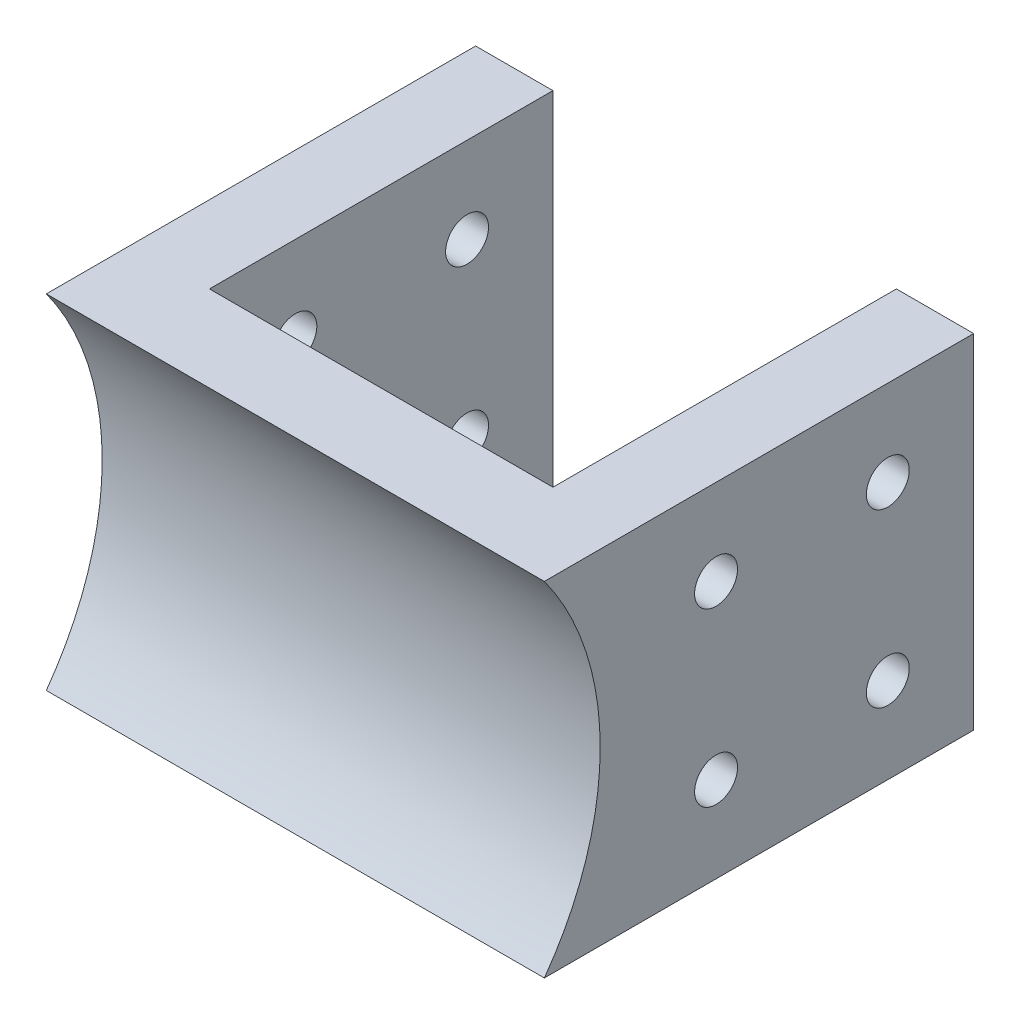
ISO-10303-21;
HEADER;
FILE_DESCRIPTION(('STEP AP214'),'2;1');
FILE_NAME('part.step','',(''),(''),'','','');
FILE_SCHEMA(('AUTOMOTIVE_DESIGN { 1 0 10303 214 1 1 1 1 }'));
ENDSEC;
DATA;
#1=APPLICATION_CONTEXT('core data for automotive mechanical design processes');
#2=APPLICATION_PROTOCOL_DEFINITION('international standard','automotive_design',2000,#1);
#3=PRODUCT_CONTEXT('',#1,'mechanical');
#4=PRODUCT('Part','Part','',(#3));
#5=PRODUCT_RELATED_PRODUCT_CATEGORY('part','',(#4));
#6=PRODUCT_DEFINITION_FORMATION('','',#4);
#7=PRODUCT_DEFINITION_CONTEXT('part definition',#1,'design');
#8=PRODUCT_DEFINITION('design','',#6,#7);
#9=PRODUCT_DEFINITION_SHAPE('','',#8);
#10=(LENGTH_UNIT() NAMED_UNIT(*) SI_UNIT(.MILLI.,.METRE.));
#11=(NAMED_UNIT(*) PLANE_ANGLE_UNIT() SI_UNIT($,.RADIAN.));
#12=(NAMED_UNIT(*) SI_UNIT($,.STERADIAN.) SOLID_ANGLE_UNIT());
#13=UNCERTAINTY_MEASURE_WITH_UNIT(LENGTH_MEASURE(1.E-05),#10,'distance_accuracy_value','');
#14=(GEOMETRIC_REPRESENTATION_CONTEXT(3) GLOBAL_UNCERTAINTY_ASSIGNED_CONTEXT((#13)) GLOBAL_UNIT_ASSIGNED_CONTEXT((#10,
#11,#12)) REPRESENTATION_CONTEXT('',''));
#15=CARTESIAN_POINT('',(0.,0.,0.));
#16=DIRECTION('',(0.,0.,1.));
#17=DIRECTION('',(1.,0.,0.));
#18=AXIS2_PLACEMENT_3D('',#15,#16,#17);
#19=CARTESIAN_POINT('',(0.,40.,-50.));
#20=DIRECTION('',(1.,0.,0.));
#21=DIRECTION('',(0.,0.,-1.));
#22=AXIS2_PLACEMENT_3D('',#19,#20,#21);
#23=PLANE('',#22);
#24=CARTESIAN_POINT('',(0.,30.,-20.));
#25=DIRECTION('',(-1.,0.,0.));
#26=DIRECTION('',(0.,0.,1.));
#27=AXIS2_PLACEMENT_3D('',#24,#25,#26);
#28=CIRCLE('',#27,2.5);
#29=CARTESIAN_POINT('',(0.,30.,-17.5));
#30=VERTEX_POINT('',#29);
#31=EDGE_CURVE('E228',#30,#30,#28,.T.);
#32=ORIENTED_EDGE('',*,*,#31,.F.);
#33=EDGE_LOOP('',(#32));
#34=FACE_BOUND('',#33,.T.);
#35=CARTESIAN_POINT('',(0.,10.,-40.));
#36=DIRECTION('',(-1.,0.,0.));
#37=DIRECTION('',(0.,0.,1.));
#38=AXIS2_PLACEMENT_3D('',#35,#36,#37);
#39=CIRCLE('',#38,2.5);
#40=CARTESIAN_POINT('',(0.,10.,-37.5));
#41=VERTEX_POINT('',#40);
#42=EDGE_CURVE('E176',#41,#41,#39,.T.);
#43=ORIENTED_EDGE('',*,*,#42,.F.);
#44=EDGE_LOOP('',(#43));
#45=FACE_BOUND('',#44,.T.);
#46=DIRECTION('',(0.,0.,1.));
#47=VECTOR('',#46,1.);
#48=CARTESIAN_POINT('',(0.,0.,-50.));
#49=LINE('',#48,#47);
#50=CARTESIAN_POINT('',(0.,0.,-50.));
#51=VERTEX_POINT('',#50);
#52=CARTESIAN_POINT('',(0.,0.,0.));
#53=VERTEX_POINT('',#52);
#54=EDGE_CURVE('E128',#51,#53,#49,.T.);
#55=ORIENTED_EDGE('',*,*,#54,.T.);
#56=CARTESIAN_POINT('',(0.,20.,27.495454169735));
#57=DIRECTION('',(1.,0.,0.));
#58=DIRECTION('',(0.,0.,-1.));
#59=AXIS2_PLACEMENT_3D('',#56,#57,#58);
#60=CIRCLE('',#59,34.);
#61=CARTESIAN_POINT('',(0.,40.,0.));
#62=VERTEX_POINT('',#61);
#63=EDGE_CURVE('E206',#53,#62,#60,.T.);
#64=ORIENTED_EDGE('',*,*,#63,.T.);
#65=DIRECTION('',(0.,0.,1.));
#66=VECTOR('',#65,1.);
#67=CARTESIAN_POINT('',(0.,40.,-50.));
#68=LINE('',#67,#66);
#69=CARTESIAN_POINT('',(0.,40.,-50.));
#70=VERTEX_POINT('',#69);
#71=EDGE_CURVE('E144',#70,#62,#68,.T.);
#72=ORIENTED_EDGE('',*,*,#71,.F.);
#73=DIRECTION('',(0.,-1.,0.));
#74=VECTOR('',#73,1.);
#75=CARTESIAN_POINT('',(0.,40.,-50.));
#76=LINE('',#75,#74);
#77=EDGE_CURVE('E124',#70,#51,#76,.T.);
#78=ORIENTED_EDGE('',*,*,#77,.T.);
#79=EDGE_LOOP('',(#55,#64,#72,#78));
#80=FACE_BOUND('',#79,.T.);
#81=CARTESIAN_POINT('',(0.,30.,-40.));
#82=DIRECTION('',(-1.,0.,0.));
#83=DIRECTION('',(0.,0.,1.));
#84=AXIS2_PLACEMENT_3D('',#81,#82,#83);
#85=CIRCLE('',#84,2.5);
#86=CARTESIAN_POINT('',(0.,30.,-37.5));
#87=VERTEX_POINT('',#86);
#88=EDGE_CURVE('E276',#87,#87,#85,.F.);
#89=ORIENTED_EDGE('',*,*,#88,.T.);
#90=EDGE_LOOP('',(#89));
#91=FACE_BOUND('',#90,.T.);
#92=CARTESIAN_POINT('',(0.,10.,-20.));
#93=DIRECTION('',(-1.,0.,0.));
#94=DIRECTION('',(0.,0.,1.));
#95=AXIS2_PLACEMENT_3D('',#92,#93,#94);
#96=CIRCLE('',#95,2.5);
#97=CARTESIAN_POINT('',(0.,10.,-17.5));
#98=VERTEX_POINT('',#97);
#99=EDGE_CURVE('E284',#98,#98,#96,.F.);
#100=ORIENTED_EDGE('',*,*,#99,.T.);
#101=EDGE_LOOP('',(#100));
#102=FACE_BOUND('',#101,.T.);
#103=ADVANCED_FACE('F33',(#34,#45,#80,#91,#102),#23,.F.);
#104=CARTESIAN_POINT('',(58.,40.,0.));
#105=DIRECTION('',(-1.,0.,0.));
#106=DIRECTION('',(0.,0.,1.));
#107=AXIS2_PLACEMENT_3D('',#104,#105,#106);
#108=PLANE('',#107);
#109=CARTESIAN_POINT('',(58.,30.,-20.));
#110=DIRECTION('',(-1.,0.,0.));
#111=DIRECTION('',(0.,0.,1.));
#112=AXIS2_PLACEMENT_3D('',#109,#110,#111);
#113=CIRCLE('',#112,2.5);
#114=CARTESIAN_POINT('',(58.,30.,-17.5));
#115=VERTEX_POINT('',#114);
#116=EDGE_CURVE('E170',#115,#115,#113,.T.);
#117=ORIENTED_EDGE('',*,*,#116,.T.);
#118=EDGE_LOOP('',(#117));
#119=FACE_BOUND('',#118,.T.);
#120=CARTESIAN_POINT('',(58.,10.,-40.));
#121=DIRECTION('',(-1.,0.,0.));
#122=DIRECTION('',(0.,0.,1.));
#123=AXIS2_PLACEMENT_3D('',#120,#121,#122);
#124=CIRCLE('',#123,2.5);
#125=CARTESIAN_POINT('',(58.,10.,-37.5));
#126=VERTEX_POINT('',#125);
#127=EDGE_CURVE('E153',#126,#126,#124,.T.);
#128=ORIENTED_EDGE('',*,*,#127,.T.);
#129=EDGE_LOOP('',(#128));
#130=FACE_BOUND('',#129,.T.);
#131=DIRECTION('',(0.,0.,-1.));
#132=VECTOR('',#131,1.);
#133=CARTESIAN_POINT('',(58.,40.,0.));
#134=LINE('',#133,#132);
#135=CARTESIAN_POINT('',(58.,40.,0.));
#136=VERTEX_POINT('',#135);
#137=CARTESIAN_POINT('',(58.,40.,-50.));
#138=VERTEX_POINT('',#137);
#139=EDGE_CURVE('E92',#136,#138,#134,.T.);
#140=ORIENTED_EDGE('',*,*,#139,.F.);
#141=CARTESIAN_POINT('',(58.,20.,27.495454169735));
#142=DIRECTION('',(1.,0.,0.));
#143=DIRECTION('',(0.,0.,-1.));
#144=AXIS2_PLACEMENT_3D('',#141,#142,#143);
#145=CIRCLE('',#144,34.);
#146=CARTESIAN_POINT('',(58.,0.,0.));
#147=VERTEX_POINT('',#146);
#148=EDGE_CURVE('E280',#147,#136,#145,.T.);
#149=ORIENTED_EDGE('',*,*,#148,.F.);
#150=DIRECTION('',(0.,0.,-1.));
#151=VECTOR('',#150,1.);
#152=CARTESIAN_POINT('',(58.,0.,0.));
#153=LINE('',#152,#151);
#154=CARTESIAN_POINT('',(58.,0.,-50.));
#155=VERTEX_POINT('',#154);
#156=EDGE_CURVE('E135',#147,#155,#153,.T.);
#157=ORIENTED_EDGE('',*,*,#156,.T.);
#158=DIRECTION('',(0.,-1.,0.));
#159=VECTOR('',#158,1.);
#160=CARTESIAN_POINT('',(58.,40.,-50.));
#161=LINE('',#160,#159);
#162=EDGE_CURVE('E11',#138,#155,#161,.T.);
#163=ORIENTED_EDGE('',*,*,#162,.F.);
#164=EDGE_LOOP('',(#140,#149,#157,#163));
#165=FACE_BOUND('',#164,.T.);
#166=CARTESIAN_POINT('',(58.,30.,-40.));
#167=DIRECTION('',(-1.,0.,0.));
#168=DIRECTION('',(0.,0.,1.));
#169=AXIS2_PLACEMENT_3D('',#166,#167,#168);
#170=CIRCLE('',#169,2.5);
#171=CARTESIAN_POINT('',(58.,30.,-37.5));
#172=VERTEX_POINT('',#171);
#173=EDGE_CURVE('E278',#172,#172,#170,.F.);
#174=ORIENTED_EDGE('',*,*,#173,.F.);
#175=EDGE_LOOP('',(#174));
#176=FACE_BOUND('',#175,.T.);
#177=CARTESIAN_POINT('',(58.,10.,-20.));
#178=DIRECTION('',(-1.,0.,0.));
#179=DIRECTION('',(0.,0.,1.));
#180=AXIS2_PLACEMENT_3D('',#177,#178,#179);
#181=CIRCLE('',#180,2.5);
#182=CARTESIAN_POINT('',(58.,10.,-17.5));
#183=VERTEX_POINT('',#182);
#184=EDGE_CURVE('E157',#183,#183,#181,.F.);
#185=ORIENTED_EDGE('',*,*,#184,.F.);
#186=EDGE_LOOP('',(#185));
#187=FACE_BOUND('',#186,.T.);
#188=ADVANCED_FACE('F219',(#119,#130,#165,#176,#187),#108,.F.);
#189=CARTESIAN_POINT('',(49.,40.,-50.));
#190=DIRECTION('',(1.,0.,0.));
#191=DIRECTION('',(0.,0.,-1.));
#192=AXIS2_PLACEMENT_3D('',#189,#190,#191);
#193=PLANE('',#192);
#194=CARTESIAN_POINT('',(49.,30.,-20.));
#195=DIRECTION('',(1.,0.,0.));
#196=DIRECTION('',(0.,0.,-1.));
#197=AXIS2_PLACEMENT_3D('',#194,#195,#196);
#198=CIRCLE('',#197,2.5);
#199=CARTESIAN_POINT('',(49.,30.,-22.5));
#200=VERTEX_POINT('',#199);
#201=EDGE_CURVE('E156',#200,#200,#198,.T.);
#202=ORIENTED_EDGE('',*,*,#201,.T.);
#203=EDGE_LOOP('',(#202));
#204=FACE_BOUND('',#203,.T.);
#205=CARTESIAN_POINT('',(49.,10.,-40.));
#206=DIRECTION('',(1.,0.,0.));
#207=DIRECTION('',(0.,0.,-1.));
#208=AXIS2_PLACEMENT_3D('',#205,#206,#207);
#209=CIRCLE('',#208,2.5);
#210=CARTESIAN_POINT('',(49.,10.,-42.5));
#211=VERTEX_POINT('',#210);
#212=EDGE_CURVE('E132',#211,#211,#209,.T.);
#213=ORIENTED_EDGE('',*,*,#212,.T.);
#214=EDGE_LOOP('',(#213));
#215=FACE_BOUND('',#214,.T.);
#216=DIRECTION('',(0.,0.,1.));
#217=VECTOR('',#216,1.);
#218=CARTESIAN_POINT('',(49.,0.,-50.));
#219=LINE('',#218,#217);
#220=CARTESIAN_POINT('',(49.,0.,-50.));
#221=VERTEX_POINT('',#220);
#222=CARTESIAN_POINT('',(49.,0.,-10.));
#223=VERTEX_POINT('',#222);
#224=EDGE_CURVE('E139',#221,#223,#219,.T.);
#225=ORIENTED_EDGE('',*,*,#224,.T.);
#226=DIRECTION('',(0.,-1.,0.));
#227=VECTOR('',#226,1.);
#228=CARTESIAN_POINT('',(49.,40.,-10.));
#229=LINE('',#228,#227);
#230=CARTESIAN_POINT('',(49.,40.,-10.));
#231=VERTEX_POINT('',#230);
#232=EDGE_CURVE('E118',#231,#223,#229,.T.);
#233=ORIENTED_EDGE('',*,*,#232,.F.);
#234=DIRECTION('',(0.,0.,1.));
#235=VECTOR('',#234,1.);
#236=CARTESIAN_POINT('',(49.,40.,-50.));
#237=LINE('',#236,#235);
#238=CARTESIAN_POINT('',(49.,40.,-50.));
#239=VERTEX_POINT('',#238);
#240=EDGE_CURVE('E109',#239,#231,#237,.T.);
#241=ORIENTED_EDGE('',*,*,#240,.F.);
#242=DIRECTION('',(0.,-1.,0.));
#243=VECTOR('',#242,1.);
#244=CARTESIAN_POINT('',(49.,40.,-50.));
#245=LINE('',#244,#243);
#246=EDGE_CURVE('E42',#239,#221,#245,.T.);
#247=ORIENTED_EDGE('',*,*,#246,.T.);
#248=EDGE_LOOP('',(#225,#233,#241,#247));
#249=FACE_BOUND('',#248,.T.);
#250=CARTESIAN_POINT('',(49.,30.,-40.));
#251=DIRECTION('',(1.,0.,0.));
#252=DIRECTION('',(0.,0.,-1.));
#253=AXIS2_PLACEMENT_3D('',#250,#251,#252);
#254=CIRCLE('',#253,2.5);
#255=CARTESIAN_POINT('',(49.,30.,-42.5));
#256=VERTEX_POINT('',#255);
#257=EDGE_CURVE('E160',#256,#256,#254,.F.);
#258=ORIENTED_EDGE('',*,*,#257,.F.);
#259=EDGE_LOOP('',(#258));
#260=FACE_BOUND('',#259,.T.);
#261=CARTESIAN_POINT('',(49.,10.,-20.));
#262=DIRECTION('',(1.,0.,0.));
#263=DIRECTION('',(0.,0.,-1.));
#264=AXIS2_PLACEMENT_3D('',#261,#262,#263);
#265=CIRCLE('',#264,2.5);
#266=CARTESIAN_POINT('',(49.,10.,-22.5));
#267=VERTEX_POINT('',#266);
#268=EDGE_CURVE('E173',#267,#267,#265,.F.);
#269=ORIENTED_EDGE('',*,*,#268,.F.);
#270=EDGE_LOOP('',(#269));
#271=FACE_BOUND('',#270,.T.);
#272=ADVANCED_FACE('F195',(#204,#215,#249,#260,#271),#193,.F.);
#273=CARTESIAN_POINT('',(9.,40.,-10.));
#274=DIRECTION('',(-1.,0.,0.));
#275=DIRECTION('',(0.,0.,1.));
#276=AXIS2_PLACEMENT_3D('',#273,#274,#275);
#277=PLANE('',#276);
#278=CARTESIAN_POINT('',(9.,30.,-20.));
#279=DIRECTION('',(-1.,0.,0.));
#280=DIRECTION('',(0.,0.,1.));
#281=AXIS2_PLACEMENT_3D('',#278,#279,#280);
#282=CIRCLE('',#281,2.5);
#283=CARTESIAN_POINT('',(9.,30.,-17.5));
#284=VERTEX_POINT('',#283);
#285=EDGE_CURVE('E154',#284,#284,#282,.T.);
#286=ORIENTED_EDGE('',*,*,#285,.T.);
#287=EDGE_LOOP('',(#286));
#288=FACE_BOUND('',#287,.T.);
#289=CARTESIAN_POINT('',(9.,10.,-40.));
#290=DIRECTION('',(-1.,0.,0.));
#291=DIRECTION('',(0.,0.,1.));
#292=AXIS2_PLACEMENT_3D('',#289,#290,#291);
#293=CIRCLE('',#292,2.5);
#294=CARTESIAN_POINT('',(9.,10.,-37.5));
#295=VERTEX_POINT('',#294);
#296=EDGE_CURVE('E150',#295,#295,#293,.T.);
#297=ORIENTED_EDGE('',*,*,#296,.T.);
#298=EDGE_LOOP('',(#297));
#299=FACE_BOUND('',#298,.T.);
#300=DIRECTION('',(0.,0.,-1.));
#301=VECTOR('',#300,1.);
#302=CARTESIAN_POINT('',(9.,0.,-10.));
#303=LINE('',#302,#301);
#304=CARTESIAN_POINT('',(9.,0.,-10.));
#305=VERTEX_POINT('',#304);
#306=CARTESIAN_POINT('',(9.,0.,-50.));
#307=VERTEX_POINT('',#306);
#308=EDGE_CURVE('E78',#305,#307,#303,.T.);
#309=ORIENTED_EDGE('',*,*,#308,.T.);
#310=DIRECTION('',(0.,-1.,0.));
#311=VECTOR('',#310,1.);
#312=CARTESIAN_POINT('',(9.,40.,-50.));
#313=LINE('',#312,#311);
#314=CARTESIAN_POINT('',(9.,40.,-50.));
#315=VERTEX_POINT('',#314);
#316=EDGE_CURVE('E119',#315,#307,#313,.T.);
#317=ORIENTED_EDGE('',*,*,#316,.F.);
#318=DIRECTION('',(0.,0.,-1.));
#319=VECTOR('',#318,1.);
#320=CARTESIAN_POINT('',(9.,40.,-10.));
#321=LINE('',#320,#319);
#322=CARTESIAN_POINT('',(9.,40.,-10.));
#323=VERTEX_POINT('',#322);
#324=EDGE_CURVE('E107',#323,#315,#321,.T.);
#325=ORIENTED_EDGE('',*,*,#324,.F.);
#326=DIRECTION('',(0.,-1.,0.));
#327=VECTOR('',#326,1.);
#328=CARTESIAN_POINT('',(9.,40.,-10.));
#329=LINE('',#328,#327);
#330=EDGE_CURVE('E114',#323,#305,#329,.T.);
#331=ORIENTED_EDGE('',*,*,#330,.T.);
#332=EDGE_LOOP('',(#309,#317,#325,#331));
#333=FACE_BOUND('',#332,.T.);
#334=CARTESIAN_POINT('',(9.,30.,-40.));
#335=DIRECTION('',(-1.,0.,0.));
#336=DIRECTION('',(0.,0.,1.));
#337=AXIS2_PLACEMENT_3D('',#334,#335,#336);
#338=CIRCLE('',#337,2.5);
#339=CARTESIAN_POINT('',(9.,30.,-37.5));
#340=VERTEX_POINT('',#339);
#341=EDGE_CURVE('E158',#340,#340,#338,.F.);
#342=ORIENTED_EDGE('',*,*,#341,.F.);
#343=EDGE_LOOP('',(#342));
#344=FACE_BOUND('',#343,.T.);
#345=CARTESIAN_POINT('',(9.,10.,-20.));
#346=DIRECTION('',(-1.,0.,0.));
#347=DIRECTION('',(0.,0.,1.));
#348=AXIS2_PLACEMENT_3D('',#345,#346,#347);
#349=CIRCLE('',#348,2.5);
#350=CARTESIAN_POINT('',(9.,10.,-17.5));
#351=VERTEX_POINT('',#350);
#352=EDGE_CURVE('E36',#351,#351,#349,.F.);
#353=ORIENTED_EDGE('',*,*,#352,.F.);
#354=EDGE_LOOP('',(#353));
#355=FACE_BOUND('',#354,.T.);
#356=ADVANCED_FACE('F121',(#288,#299,#333,#344,#355),#277,.F.);
#357=CARTESIAN_POINT('',(58.,40.,-50.));
#358=DIRECTION('',(0.,0.,1.));
#359=DIRECTION('',(1.,0.,0.));
#360=AXIS2_PLACEMENT_3D('',#357,#358,#359);
#361=PLANE('',#360);
#362=DIRECTION('',(-1.,0.,0.));
#363=VECTOR('',#362,1.);
#364=CARTESIAN_POINT('',(58.,0.,-50.));
#365=LINE('',#364,#363);
#366=EDGE_CURVE('E137',#155,#221,#365,.T.);
#367=ORIENTED_EDGE('',*,*,#366,.T.);
#368=ORIENTED_EDGE('',*,*,#246,.F.);
#369=DIRECTION('',(-1.,0.,0.));
#370=VECTOR('',#369,1.);
#371=CARTESIAN_POINT('',(58.,40.,-50.));
#372=LINE('',#371,#370);
#373=EDGE_CURVE('E187',#138,#239,#372,.T.);
#374=ORIENTED_EDGE('',*,*,#373,.F.);
#375=ORIENTED_EDGE('',*,*,#162,.T.);
#376=EDGE_LOOP('',(#367,#368,#374,#375));
#377=FACE_BOUND('',#376,.T.);
#378=ADVANCED_FACE('F191',(#377),#361,.F.);
#379=CARTESIAN_POINT('',(49.,40.,-10.));
#380=DIRECTION('',(0.,0.,1.));
#381=DIRECTION('',(1.,0.,0.));
#382=AXIS2_PLACEMENT_3D('',#379,#380,#381);
#383=PLANE('',#382);
#384=DIRECTION('',(-1.,0.,0.));
#385=VECTOR('',#384,1.);
#386=CARTESIAN_POINT('',(49.,0.,-10.));
#387=LINE('',#386,#385);
#388=EDGE_CURVE('E117',#223,#305,#387,.T.);
#389=ORIENTED_EDGE('',*,*,#388,.T.);
#390=ORIENTED_EDGE('',*,*,#330,.F.);
#391=DIRECTION('',(-1.,0.,0.));
#392=VECTOR('',#391,1.);
#393=CARTESIAN_POINT('',(49.,40.,-10.));
#394=LINE('',#393,#392);
#395=EDGE_CURVE('E103',#231,#323,#394,.T.);
#396=ORIENTED_EDGE('',*,*,#395,.F.);
#397=ORIENTED_EDGE('',*,*,#232,.T.);
#398=EDGE_LOOP('',(#389,#390,#396,#397));
#399=FACE_BOUND('',#398,.T.);
#400=ADVANCED_FACE('F115',(#399),#383,.F.);
#401=CARTESIAN_POINT('',(9.,40.,-50.));
#402=DIRECTION('',(0.,0.,1.));
#403=DIRECTION('',(1.,0.,0.));
#404=AXIS2_PLACEMENT_3D('',#401,#402,#403);
#405=PLANE('',#404);
#406=DIRECTION('',(-1.,0.,0.));
#407=VECTOR('',#406,1.);
#408=CARTESIAN_POINT('',(9.,0.,-50.));
#409=LINE('',#408,#407);
#410=EDGE_CURVE('E84',#307,#51,#409,.T.);
#411=ORIENTED_EDGE('',*,*,#410,.T.);
#412=ORIENTED_EDGE('',*,*,#77,.F.);
#413=DIRECTION('',(-1.,0.,0.));
#414=VECTOR('',#413,1.);
#415=CARTESIAN_POINT('',(9.,40.,-50.));
#416=LINE('',#415,#414);
#417=EDGE_CURVE('E51',#315,#70,#416,.T.);
#418=ORIENTED_EDGE('',*,*,#417,.F.);
#419=ORIENTED_EDGE('',*,*,#316,.T.);
#420=EDGE_LOOP('',(#411,#412,#418,#419));
#421=FACE_BOUND('',#420,.T.);
#422=ADVANCED_FACE('F207',(#421),#405,.F.);
#423=CARTESIAN_POINT('',(0.,40.,0.));
#424=DIRECTION('',(0.,1.,0.));
#425=DIRECTION('',(0.,0.,1.));
#426=AXIS2_PLACEMENT_3D('',#423,#424,#425);
#427=PLANE('',#426);
#428=ORIENTED_EDGE('',*,*,#71,.T.);
#429=DIRECTION('',(1.,0.,0.));
#430=VECTOR('',#429,1.);
#431=CARTESIAN_POINT('',(0.,40.,0.));
#432=LINE('',#431,#430);
#433=EDGE_CURVE('E184',#62,#136,#432,.T.);
#434=ORIENTED_EDGE('',*,*,#433,.T.);
#435=ORIENTED_EDGE('',*,*,#139,.T.);
#436=ORIENTED_EDGE('',*,*,#373,.T.);
#437=ORIENTED_EDGE('',*,*,#240,.T.);
#438=ORIENTED_EDGE('',*,*,#395,.T.);
#439=ORIENTED_EDGE('',*,*,#324,.T.);
#440=ORIENTED_EDGE('',*,*,#417,.T.);
#441=EDGE_LOOP('',(#428,#434,#435,#436,#437,#438,#439,#440));
#442=FACE_BOUND('',#441,.T.);
#443=ADVANCED_FACE('F105',(#442),#427,.T.);
#444=CARTESIAN_POINT('',(0.,0.,0.));
#445=DIRECTION('',(0.,1.,0.));
#446=DIRECTION('',(0.,0.,1.));
#447=AXIS2_PLACEMENT_3D('',#444,#445,#446);
#448=PLANE('',#447);
#449=ORIENTED_EDGE('',*,*,#54,.F.);
#450=ORIENTED_EDGE('',*,*,#410,.F.);
#451=ORIENTED_EDGE('',*,*,#308,.F.);
#452=ORIENTED_EDGE('',*,*,#388,.F.);
#453=ORIENTED_EDGE('',*,*,#224,.F.);
#454=ORIENTED_EDGE('',*,*,#366,.F.);
#455=ORIENTED_EDGE('',*,*,#156,.F.);
#456=DIRECTION('',(1.,0.,0.));
#457=VECTOR('',#456,1.);
#458=CARTESIAN_POINT('',(0.,0.,0.));
#459=LINE('',#458,#457);
#460=EDGE_CURVE('E131',#53,#147,#459,.T.);
#461=ORIENTED_EDGE('',*,*,#460,.F.);
#462=EDGE_LOOP('',(#449,#450,#451,#452,#453,#454,#455,#461));
#463=FACE_BOUND('',#462,.T.);
#464=ADVANCED_FACE('F199',(#463),#448,.F.);
#465=CARTESIAN_POINT('',(58.,10.,-40.));
#466=DIRECTION('',(-1.,0.,0.));
#467=DIRECTION('',(0.,0.,1.));
#468=AXIS2_PLACEMENT_3D('',#465,#466,#467);
#469=CYLINDRICAL_SURFACE('',#468,2.5);
#470=ORIENTED_EDGE('',*,*,#42,.T.);
#471=EDGE_LOOP('',(#470));
#472=FACE_BOUND('',#471,.T.);
#473=ORIENTED_EDGE('',*,*,#296,.F.);
#474=EDGE_LOOP('',(#473));
#475=FACE_BOUND('',#474,.T.);
#476=ADVANCED_FACE('F231',(#472,#475),#469,.F.);
#477=ORIENTED_EDGE('',*,*,#127,.F.);
#478=EDGE_LOOP('',(#477));
#479=FACE_BOUND('',#478,.T.);
#480=ORIENTED_EDGE('',*,*,#212,.F.);
#481=EDGE_LOOP('',(#480));
#482=FACE_BOUND('',#481,.T.);
#483=ADVANCED_FACE('F234',(#479,#482),#469,.F.);
#484=CARTESIAN_POINT('',(58.,30.,-20.));
#485=DIRECTION('',(-1.,0.,0.));
#486=DIRECTION('',(0.,0.,1.));
#487=AXIS2_PLACEMENT_3D('',#484,#485,#486);
#488=CYLINDRICAL_SURFACE('',#487,2.5);
#489=ORIENTED_EDGE('',*,*,#31,.T.);
#490=EDGE_LOOP('',(#489));
#491=FACE_BOUND('',#490,.T.);
#492=ORIENTED_EDGE('',*,*,#285,.F.);
#493=EDGE_LOOP('',(#492));
#494=FACE_BOUND('',#493,.T.);
#495=ADVANCED_FACE('F248',(#491,#494),#488,.F.);
#496=CARTESIAN_POINT('',(58.,30.,-40.));
#497=DIRECTION('',(-1.,0.,0.));
#498=DIRECTION('',(0.,0.,1.));
#499=AXIS2_PLACEMENT_3D('',#496,#497,#498);
#500=CYLINDRICAL_SURFACE('',#499,2.5);
#501=ORIENTED_EDGE('',*,*,#88,.F.);
#502=EDGE_LOOP('',(#501));
#503=FACE_BOUND('',#502,.T.);
#504=ORIENTED_EDGE('',*,*,#341,.T.);
#505=EDGE_LOOP('',(#504));
#506=FACE_BOUND('',#505,.T.);
#507=ADVANCED_FACE('F250',(#503,#506),#500,.F.);
#508=CARTESIAN_POINT('',(58.,10.,-20.));
#509=DIRECTION('',(-1.,0.,0.));
#510=DIRECTION('',(0.,0.,1.));
#511=AXIS2_PLACEMENT_3D('',#508,#509,#510);
#512=CYLINDRICAL_SURFACE('',#511,2.5);
#513=ORIENTED_EDGE('',*,*,#99,.F.);
#514=EDGE_LOOP('',(#513));
#515=FACE_BOUND('',#514,.T.);
#516=ORIENTED_EDGE('',*,*,#352,.T.);
#517=EDGE_LOOP('',(#516));
#518=FACE_BOUND('',#517,.T.);
#519=ADVANCED_FACE('F258',(#515,#518),#512,.F.);
#520=ORIENTED_EDGE('',*,*,#116,.F.);
#521=EDGE_LOOP('',(#520));
#522=FACE_BOUND('',#521,.T.);
#523=ORIENTED_EDGE('',*,*,#201,.F.);
#524=EDGE_LOOP('',(#523));
#525=FACE_BOUND('',#524,.T.);
#526=ADVANCED_FACE('F253',(#522,#525),#488,.F.);
#527=ORIENTED_EDGE('',*,*,#173,.T.);
#528=EDGE_LOOP('',(#527));
#529=FACE_BOUND('',#528,.T.);
#530=ORIENTED_EDGE('',*,*,#257,.T.);
#531=EDGE_LOOP('',(#530));
#532=FACE_BOUND('',#531,.T.);
#533=ADVANCED_FACE('F261',(#529,#532),#500,.F.);
#534=ORIENTED_EDGE('',*,*,#184,.T.);
#535=EDGE_LOOP('',(#534));
#536=FACE_BOUND('',#535,.T.);
#537=ORIENTED_EDGE('',*,*,#268,.T.);
#538=EDGE_LOOP('',(#537));
#539=FACE_BOUND('',#538,.T.);
#540=ADVANCED_FACE('F269',(#536,#539),#512,.F.);
#541=CARTESIAN_POINT('',(0.,20.,27.495454169735));
#542=DIRECTION('',(1.,0.,0.));
#543=DIRECTION('',(0.,0.,-1.));
#544=AXIS2_PLACEMENT_3D('',#541,#542,#543);
#545=CYLINDRICAL_SURFACE('',#544,34.);
#546=ORIENTED_EDGE('',*,*,#148,.T.);
#547=ORIENTED_EDGE('',*,*,#433,.F.);
#548=ORIENTED_EDGE('',*,*,#63,.F.);
#549=ORIENTED_EDGE('',*,*,#460,.T.);
#550=EDGE_LOOP('',(#546,#547,#548,#549));
#551=FACE_BOUND('',#550,.T.);
#552=ADVANCED_FACE('F295',(#551),#545,.F.);
#553=CLOSED_SHELL('',(#103,#188,#272,#356,#378,#400,#422,#443,#464,#476,#483,#495,#507,#519,
#526,#533,#540,#552));
#554=MANIFOLD_SOLID_BREP('B2',#553);
#555=ADVANCED_BREP_SHAPE_REPRESENTATION('',(#18,#554),#14);
#556=SHAPE_DEFINITION_REPRESENTATION(#9,#555);
ENDSEC;
END-ISO-10303-21;
